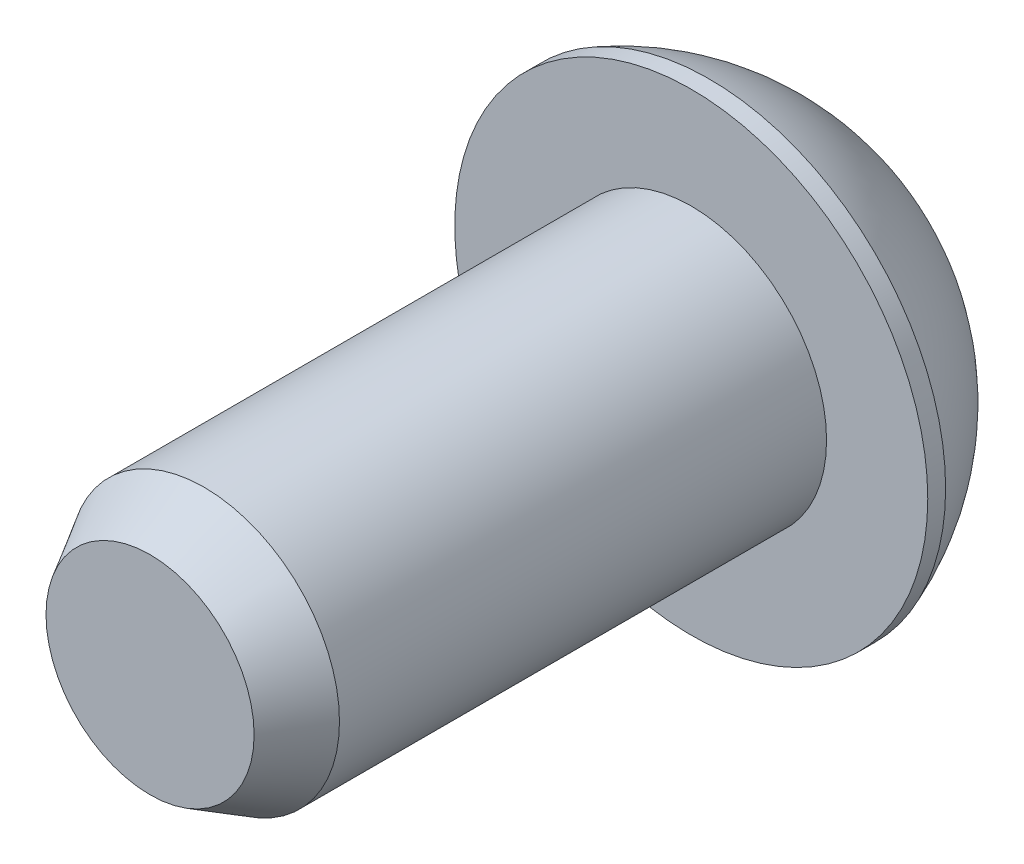
ISO-10303-21;
HEADER;
FILE_DESCRIPTION(('STEP AP214'),'2;1');
FILE_NAME('part.step','',(''),(''),'','','');
FILE_SCHEMA(('AUTOMOTIVE_DESIGN { 1 0 10303 214 1 1 1 1 }'));
ENDSEC;
DATA;
#1=APPLICATION_CONTEXT('core data for automotive mechanical design processes');
#2=APPLICATION_PROTOCOL_DEFINITION('international standard','automotive_design',2000,#1);
#3=PRODUCT_CONTEXT('',#1,'mechanical');
#4=PRODUCT('Part','Part','',(#3));
#5=PRODUCT_RELATED_PRODUCT_CATEGORY('part','',(#4));
#6=PRODUCT_DEFINITION_FORMATION('','',#4);
#7=PRODUCT_DEFINITION_CONTEXT('part definition',#1,'design');
#8=PRODUCT_DEFINITION('design','',#6,#7);
#9=PRODUCT_DEFINITION_SHAPE('','',#8);
#10=(LENGTH_UNIT() NAMED_UNIT(*) SI_UNIT(.MILLI.,.METRE.));
#11=(NAMED_UNIT(*) PLANE_ANGLE_UNIT() SI_UNIT($,.RADIAN.));
#12=(NAMED_UNIT(*) SI_UNIT($,.STERADIAN.) SOLID_ANGLE_UNIT());
#13=UNCERTAINTY_MEASURE_WITH_UNIT(LENGTH_MEASURE(1.E-05),#10,'distance_accuracy_value','');
#14=(GEOMETRIC_REPRESENTATION_CONTEXT(3) GLOBAL_UNCERTAINTY_ASSIGNED_CONTEXT((#13)) GLOBAL_UNIT_ASSIGNED_CONTEXT((#10,
#11,#12)) REPRESENTATION_CONTEXT('',''));
#15=CARTESIAN_POINT('',(0.,0.,0.));
#16=DIRECTION('',(0.,0.,1.));
#17=DIRECTION('',(1.,0.,0.));
#18=AXIS2_PLACEMENT_3D('',#15,#16,#17);
#19=CARTESIAN_POINT('',(5.54989996262456,0.,3.35279999999998));
#20=DIRECTION('',(0.,0.,1.));
#21=DIRECTION('',(1.,0.,0.));
#22=AXIS2_PLACEMENT_3D('',#19,#20,#21);
#23=PLANE('',#22);
#24=CARTESIAN_POINT('',(-1.63057978577741E-08,0.,3.35279999999998));
#25=DIRECTION('',(0.,0.,1.));
#26=DIRECTION('',(1.,0.,0.));
#27=AXIS2_PLACEMENT_3D('',#24,#25,#26);
#28=CIRCLE('',#27,5.54989997893035);
#29=CARTESIAN_POINT('',(5.54989996262456,0.,3.35279999999998));
#30=VERTEX_POINT('',#29);
#31=EDGE_CURVE('E143',#30,#30,#28,.T.);
#32=ORIENTED_EDGE('',*,*,#31,.T.);
#33=EDGE_LOOP('',(#32));
#34=FACE_BOUND('',#33,.T.);
#35=CARTESIAN_POINT('',(0.,0.,3.35279999999998));
#36=DIRECTION('',(0.,0.,1.));
#37=DIRECTION('',(1.,0.,0.));
#38=AXIS2_PLACEMENT_3D('',#35,#36,#37);
#39=CIRCLE('',#38,3.175);
#40=CARTESIAN_POINT('',(3.175,0.,3.35279999999998));
#41=VERTEX_POINT('',#40);
#42=EDGE_CURVE('E122',#41,#41,#39,.T.);
#43=ORIENTED_EDGE('',*,*,#42,.F.);
#44=EDGE_LOOP('',(#43));
#45=FACE_BOUND('',#44,.T.);
#46=ADVANCED_FACE('F32',(#34,#45),#23,.T.);
#47=CARTESIAN_POINT('',(-2.10696917489483E-08,0.,4.99835714285724));
#48=DIRECTION('',(0.,0.,1.));
#49=DIRECTION('',(1.,0.,0.));
#50=AXIS2_PLACEMENT_3D('',#47,#48,#49);
#51=SPHERICAL_SURFACE('',#50,5.92150311760007);
#52=CARTESIAN_POINT('',(-1.63057978577741E-08,0.,0.));
#53=DIRECTION('',(0.,0.,1.));
#54=DIRECTION('',(1.,0.,0.));
#55=AXIS2_PLACEMENT_3D('',#52,#53,#54);
#56=CIRCLE('',#55,3.17500000219601);
#57=CARTESIAN_POINT('',(3.17499998589021,0.,0.));
#58=VERTEX_POINT('',#57);
#59=EDGE_CURVE('E146',#58,#58,#56,.T.);
#60=ORIENTED_EDGE('',*,*,#59,.T.);
#61=EDGE_LOOP('',(#60));
#62=FACE_BOUND('',#61,.T.);
#63=CARTESIAN_POINT('',(-1.63057978577741E-08,0.,2.93369994546637));
#64=DIRECTION('',(0.,0.,1.));
#65=DIRECTION('',(1.,0.,0.));
#66=AXIS2_PLACEMENT_3D('',#63,#64,#65);
#67=CIRCLE('',#66,5.54989997893035);
#68=CARTESIAN_POINT('',(5.54989996262456,0.,2.93369994546637));
#69=VERTEX_POINT('',#68);
#70=EDGE_CURVE('E135',#69,#69,#67,.T.);
#71=ORIENTED_EDGE('',*,*,#70,.F.);
#72=EDGE_LOOP('',(#71));
#73=FACE_BOUND('',#72,.T.);
#74=ADVANCED_FACE('F162',(#62,#73),#51,.T.);
#75=CARTESIAN_POINT('',(-1.63057978577741E-08,0.,0.));
#76=DIRECTION('',(0.,0.,-1.));
#77=DIRECTION('',(-1.,0.,0.));
#78=AXIS2_PLACEMENT_3D('',#75,#76,#77);
#79=PLANE('',#78);
#80=DIRECTION('',(-0.5,0.866025403784439,0.));
#81=VECTOR('',#80,1.);
#82=CARTESIAN_POINT('',(-1.14567944042316,-1.984375,0.));
#83=LINE('',#82,#81);
#84=CARTESIAN_POINT('',(-1.14567944042316,-1.984375,0.));
#85=VERTEX_POINT('',#84);
#86=CARTESIAN_POINT('',(-2.29135888084633,0.,0.));
#87=VERTEX_POINT('',#86);
#88=EDGE_CURVE('E47',#85,#87,#83,.T.);
#89=ORIENTED_EDGE('',*,*,#88,.F.);
#90=DIRECTION('',(-1.,0.,0.));
#91=VECTOR('',#90,1.);
#92=CARTESIAN_POINT('',(1.14567944042316,-1.984375,0.));
#93=LINE('',#92,#91);
#94=CARTESIAN_POINT('',(1.14567944042316,-1.984375,0.));
#95=VERTEX_POINT('',#94);
#96=EDGE_CURVE('E131',#95,#85,#93,.T.);
#97=ORIENTED_EDGE('',*,*,#96,.F.);
#98=DIRECTION('',(-0.5,-0.866025403784438,0.));
#99=VECTOR('',#98,1.);
#100=CARTESIAN_POINT('',(2.29135888084633,0.,0.));
#101=LINE('',#100,#99);
#102=CARTESIAN_POINT('',(2.29135888084633,0.,0.));
#103=VERTEX_POINT('',#102);
#104=EDGE_CURVE('E129',#103,#95,#101,.T.);
#105=ORIENTED_EDGE('',*,*,#104,.F.);
#106=DIRECTION('',(0.5,-0.866025403784439,0.));
#107=VECTOR('',#106,1.);
#108=CARTESIAN_POINT('',(1.14567944042317,1.984375,0.));
#109=LINE('',#108,#107);
#110=CARTESIAN_POINT('',(1.14567944042317,1.984375,0.));
#111=VERTEX_POINT('',#110);
#112=EDGE_CURVE('E95',#111,#103,#109,.T.);
#113=ORIENTED_EDGE('',*,*,#112,.F.);
#114=DIRECTION('',(1.,0.,0.));
#115=VECTOR('',#114,1.);
#116=CARTESIAN_POINT('',(-1.14567944042316,1.984375,0.));
#117=LINE('',#116,#115);
#118=CARTESIAN_POINT('',(-1.14567944042316,1.984375,0.));
#119=VERTEX_POINT('',#118);
#120=EDGE_CURVE('E125',#119,#111,#117,.T.);
#121=ORIENTED_EDGE('',*,*,#120,.F.);
#122=DIRECTION('',(0.5,0.866025403784439,0.));
#123=VECTOR('',#122,1.);
#124=CARTESIAN_POINT('',(-2.29135888084633,0.,0.));
#125=LINE('',#124,#123);
#126=EDGE_CURVE('E121',#87,#119,#125,.T.);
#127=ORIENTED_EDGE('',*,*,#126,.F.);
#128=EDGE_LOOP('',(#89,#97,#105,#113,#121,#127));
#129=FACE_BOUND('',#128,.T.);
#130=ORIENTED_EDGE('',*,*,#59,.F.);
#131=EDGE_LOOP('',(#130));
#132=FACE_BOUND('',#131,.T.);
#133=ADVANCED_FACE('F168',(#129,#132),#79,.T.);
#134=CARTESIAN_POINT('',(-1.63057978577741E-08,0.,0.));
#135=DIRECTION('',(0.,0.,1.));
#136=DIRECTION('',(1.,0.,0.));
#137=AXIS2_PLACEMENT_3D('',#134,#135,#136);
#138=CYLINDRICAL_SURFACE('',#137,5.54989997893035);
#139=ORIENTED_EDGE('',*,*,#70,.T.);
#140=EDGE_LOOP('',(#139));
#141=FACE_BOUND('',#140,.T.);
#142=ORIENTED_EDGE('',*,*,#31,.F.);
#143=EDGE_LOOP('',(#142));
#144=FACE_BOUND('',#143,.T.);
#145=ADVANCED_FACE('F173',(#141,#144),#138,.T.);
#146=CARTESIAN_POINT('',(-1.14567944042316,-1.984375,2.2225));
#147=DIRECTION('',(-0.866025403784439,-0.5,0.));
#148=DIRECTION('',(0.5,-0.866025403784439,0.));
#149=AXIS2_PLACEMENT_3D('',#146,#147,#148);
#150=PLANE('',#149);
#151=ORIENTED_EDGE('',*,*,#88,.T.);
#152=DIRECTION('',(0.,0.,-1.));
#153=VECTOR('',#152,1.);
#154=CARTESIAN_POINT('',(-2.29135888084633,0.,2.2225));
#155=LINE('',#154,#153);
#156=CARTESIAN_POINT('',(-2.29135888084633,0.,2.2225));
#157=VERTEX_POINT('',#156);
#158=EDGE_CURVE('E77',#157,#87,#155,.T.);
#159=ORIENTED_EDGE('',*,*,#158,.F.);
#160=DIRECTION('',(-0.5,0.866025403784439,0.));
#161=VECTOR('',#160,1.);
#162=CARTESIAN_POINT('',(-1.14567944042316,-1.984375,2.2225));
#163=LINE('',#162,#161);
#164=CARTESIAN_POINT('',(-1.14567944042316,-1.984375,2.2225));
#165=VERTEX_POINT('',#164);
#166=EDGE_CURVE('E133',#165,#157,#163,.T.);
#167=ORIENTED_EDGE('',*,*,#166,.F.);
#168=DIRECTION('',(0.,0.,-1.));
#169=VECTOR('',#168,1.);
#170=CARTESIAN_POINT('',(-1.14567944042316,-1.984375,2.2225));
#171=LINE('',#170,#169);
#172=EDGE_CURVE('E55',#165,#85,#171,.T.);
#173=ORIENTED_EDGE('',*,*,#172,.T.);
#174=EDGE_LOOP('',(#151,#159,#167,#173));
#175=FACE_BOUND('',#174,.T.);
#176=ADVANCED_FACE('F180',(#175),#150,.F.);
#177=CARTESIAN_POINT('',(1.14567944042316,-1.984375,2.2225));
#178=DIRECTION('',(0.,-1.,0.));
#179=DIRECTION('',(1.,0.,0.));
#180=AXIS2_PLACEMENT_3D('',#177,#178,#179);
#181=PLANE('',#180);
#182=ORIENTED_EDGE('',*,*,#96,.T.);
#183=ORIENTED_EDGE('',*,*,#172,.F.);
#184=DIRECTION('',(-1.,0.,0.));
#185=VECTOR('',#184,1.);
#186=CARTESIAN_POINT('',(1.14567944042316,-1.984375,2.2225));
#187=LINE('',#186,#185);
#188=CARTESIAN_POINT('',(1.14567944042316,-1.984375,2.2225));
#189=VERTEX_POINT('',#188);
#190=EDGE_CURVE('E107',#189,#165,#187,.T.);
#191=ORIENTED_EDGE('',*,*,#190,.F.);
#192=DIRECTION('',(0.,0.,-1.));
#193=VECTOR('',#192,1.);
#194=CARTESIAN_POINT('',(1.14567944042316,-1.984375,2.2225));
#195=LINE('',#194,#193);
#196=EDGE_CURVE('E99',#189,#95,#195,.T.);
#197=ORIENTED_EDGE('',*,*,#196,.T.);
#198=EDGE_LOOP('',(#182,#183,#191,#197));
#199=FACE_BOUND('',#198,.T.);
#200=ADVANCED_FACE('F206',(#199),#181,.F.);
#201=CARTESIAN_POINT('',(2.29135888084633,0.,2.2225));
#202=DIRECTION('',(0.866025403784438,-0.5,0.));
#203=DIRECTION('',(0.5,0.866025403784439,0.));
#204=AXIS2_PLACEMENT_3D('',#201,#202,#203);
#205=PLANE('',#204);
#206=ORIENTED_EDGE('',*,*,#104,.T.);
#207=ORIENTED_EDGE('',*,*,#196,.F.);
#208=DIRECTION('',(-0.5,-0.866025403784438,0.));
#209=VECTOR('',#208,1.);
#210=CARTESIAN_POINT('',(2.29135888084633,0.,2.2225));
#211=LINE('',#210,#209);
#212=CARTESIAN_POINT('',(2.29135888084633,0.,2.2225));
#213=VERTEX_POINT('',#212);
#214=EDGE_CURVE('E103',#213,#189,#211,.T.);
#215=ORIENTED_EDGE('',*,*,#214,.F.);
#216=DIRECTION('',(0.,0.,-1.));
#217=VECTOR('',#216,1.);
#218=CARTESIAN_POINT('',(2.29135888084633,0.,2.2225));
#219=LINE('',#218,#217);
#220=EDGE_CURVE('E88',#213,#103,#219,.T.);
#221=ORIENTED_EDGE('',*,*,#220,.T.);
#222=EDGE_LOOP('',(#206,#207,#215,#221));
#223=FACE_BOUND('',#222,.T.);
#224=ADVANCED_FACE('F104',(#223),#205,.F.);
#225=CARTESIAN_POINT('',(1.14567944042317,1.984375,2.2225));
#226=DIRECTION('',(0.866025403784439,0.5,0.));
#227=DIRECTION('',(-0.5,0.866025403784439,0.));
#228=AXIS2_PLACEMENT_3D('',#225,#226,#227);
#229=PLANE('',#228);
#230=ORIENTED_EDGE('',*,*,#112,.T.);
#231=ORIENTED_EDGE('',*,*,#220,.F.);
#232=DIRECTION('',(0.5,-0.866025403784439,0.));
#233=VECTOR('',#232,1.);
#234=CARTESIAN_POINT('',(1.14567944042317,1.984375,2.2225));
#235=LINE('',#234,#233);
#236=CARTESIAN_POINT('',(1.14567944042317,1.984375,2.2225));
#237=VERTEX_POINT('',#236);
#238=EDGE_CURVE('E92',#237,#213,#235,.T.);
#239=ORIENTED_EDGE('',*,*,#238,.F.);
#240=DIRECTION('',(0.,0.,-1.));
#241=VECTOR('',#240,1.);
#242=CARTESIAN_POINT('',(1.14567944042317,1.984375,2.2225));
#243=LINE('',#242,#241);
#244=EDGE_CURVE('E100',#237,#111,#243,.T.);
#245=ORIENTED_EDGE('',*,*,#244,.T.);
#246=EDGE_LOOP('',(#230,#231,#239,#245));
#247=FACE_BOUND('',#246,.T.);
#248=ADVANCED_FACE('F90',(#247),#229,.F.);
#249=CARTESIAN_POINT('',(-1.14567944042316,1.984375,2.2225));
#250=DIRECTION('',(0.,1.,0.));
#251=DIRECTION('',(-1.,0.,0.));
#252=AXIS2_PLACEMENT_3D('',#249,#250,#251);
#253=PLANE('',#252);
#254=ORIENTED_EDGE('',*,*,#120,.T.);
#255=ORIENTED_EDGE('',*,*,#244,.F.);
#256=DIRECTION('',(1.,0.,0.));
#257=VECTOR('',#256,1.);
#258=CARTESIAN_POINT('',(-1.14567944042316,1.984375,2.2225));
#259=LINE('',#258,#257);
#260=CARTESIAN_POINT('',(-1.14567944042316,1.984375,2.2225));
#261=VERTEX_POINT('',#260);
#262=EDGE_CURVE('E113',#261,#237,#259,.T.);
#263=ORIENTED_EDGE('',*,*,#262,.F.);
#264=DIRECTION('',(0.,0.,-1.));
#265=VECTOR('',#264,1.);
#266=CARTESIAN_POINT('',(-1.14567944042316,1.984375,2.2225));
#267=LINE('',#266,#265);
#268=EDGE_CURVE('E138',#261,#119,#267,.T.);
#269=ORIENTED_EDGE('',*,*,#268,.T.);
#270=EDGE_LOOP('',(#254,#255,#263,#269));
#271=FACE_BOUND('',#270,.T.);
#272=ADVANCED_FACE('F213',(#271),#253,.F.);
#273=CARTESIAN_POINT('',(-2.29135888084633,0.,2.2225));
#274=DIRECTION('',(-0.866025403784439,0.5,0.));
#275=DIRECTION('',(-0.5,-0.866025403784439,0.));
#276=AXIS2_PLACEMENT_3D('',#273,#274,#275);
#277=PLANE('',#276);
#278=ORIENTED_EDGE('',*,*,#126,.T.);
#279=ORIENTED_EDGE('',*,*,#268,.F.);
#280=DIRECTION('',(0.5,0.866025403784439,0.));
#281=VECTOR('',#280,1.);
#282=CARTESIAN_POINT('',(-2.29135888084633,0.,2.2225));
#283=LINE('',#282,#281);
#284=EDGE_CURVE('E115',#157,#261,#283,.T.);
#285=ORIENTED_EDGE('',*,*,#284,.F.);
#286=ORIENTED_EDGE('',*,*,#158,.T.);
#287=EDGE_LOOP('',(#278,#279,#285,#286));
#288=FACE_BOUND('',#287,.T.);
#289=ADVANCED_FACE('F192',(#288),#277,.F.);
#290=CARTESIAN_POINT('',(-2.29135888084633,0.,2.2225));
#291=DIRECTION('',(0.,0.,-1.));
#292=DIRECTION('',(-1.,0.,0.));
#293=AXIS2_PLACEMENT_3D('',#290,#291,#292);
#294=PLANE('',#293);
#295=ORIENTED_EDGE('',*,*,#166,.T.);
#296=ORIENTED_EDGE('',*,*,#284,.T.);
#297=ORIENTED_EDGE('',*,*,#262,.T.);
#298=ORIENTED_EDGE('',*,*,#238,.T.);
#299=ORIENTED_EDGE('',*,*,#214,.T.);
#300=ORIENTED_EDGE('',*,*,#190,.T.);
#301=EDGE_LOOP('',(#295,#296,#297,#298,#299,#300));
#302=FACE_BOUND('',#301,.T.);
#303=ADVANCED_FACE('F110',(#302),#294,.T.);
#304=CARTESIAN_POINT('',(0.,0.,16.0528));
#305=DIRECTION('',(0.,0.,-1.));
#306=DIRECTION('',(-1.,0.,0.));
#307=AXIS2_PLACEMENT_3D('',#304,#305,#306);
#308=CYLINDRICAL_SURFACE('',#307,3.175);
#309=CARTESIAN_POINT('',(0.,0.,14.7828));
#310=DIRECTION('',(0.,0.,1.));
#311=DIRECTION('',(1.,0.,0.));
#312=AXIS2_PLACEMENT_3D('',#309,#310,#311);
#313=CIRCLE('',#312,3.175);
#314=CARTESIAN_POINT('',(3.175,0.,14.7828));
#315=VERTEX_POINT('',#314);
#316=EDGE_CURVE('E11',#315,#315,#313,.F.);
#317=ORIENTED_EDGE('',*,*,#316,.T.);
#318=EDGE_LOOP('',(#317));
#319=FACE_BOUND('',#318,.T.);
#320=ORIENTED_EDGE('',*,*,#42,.T.);
#321=EDGE_LOOP('',(#320));
#322=FACE_BOUND('',#321,.T.);
#323=ADVANCED_FACE('F158',(#319,#322),#308,.T.);
#324=CARTESIAN_POINT('',(0.,0.,16.0528));
#325=DIRECTION('',(0.,0.,1.));
#326=DIRECTION('',(1.,0.,0.));
#327=AXIS2_PLACEMENT_3D('',#324,#325,#326);
#328=PLANE('',#327);
#329=CARTESIAN_POINT('',(0.,0.,16.0528));
#330=DIRECTION('',(0.,0.,1.));
#331=DIRECTION('',(1.,0.,0.));
#332=AXIS2_PLACEMENT_3D('',#329,#330,#331);
#333=CIRCLE('',#332,2.44176515812917);
#334=CARTESIAN_POINT('',(2.44176515812917,0.,16.0528));
#335=VERTEX_POINT('',#334);
#336=EDGE_CURVE('E40',#335,#335,#333,.T.);
#337=ORIENTED_EDGE('',*,*,#336,.T.);
#338=EDGE_LOOP('',(#337));
#339=FACE_BOUND('',#338,.T.);
#340=ADVANCED_FACE('F151',(#339),#328,.T.);
#341=CARTESIAN_POINT('',(0.,0.,16.0528));
#342=DIRECTION('',(0.,0.,-1.));
#343=DIRECTION('',(-1.,0.,0.));
#344=AXIS2_PLACEMENT_3D('',#341,#342,#343);
#345=CONICAL_SURFACE('',#344,2.44176515812917,0.523598775598296);
#346=ORIENTED_EDGE('',*,*,#316,.F.);
#347=EDGE_LOOP('',(#346));
#348=FACE_BOUND('',#347,.T.);
#349=ORIENTED_EDGE('',*,*,#336,.F.);
#350=EDGE_LOOP('',(#349));
#351=FACE_BOUND('',#350,.T.);
#352=ADVANCED_FACE('F34',(#348,#351),#345,.T.);
#353=CLOSED_SHELL('',(#46,#74,#133,#145,#176,#200,#224,#248,#272,#289,#303,#323,#340,#352));
#354=MANIFOLD_SOLID_BREP('B2',#353);
#355=ADVANCED_BREP_SHAPE_REPRESENTATION('',(#18,#354),#14);
#356=SHAPE_DEFINITION_REPRESENTATION(#9,#355);
ENDSEC;
END-ISO-10303-21;
